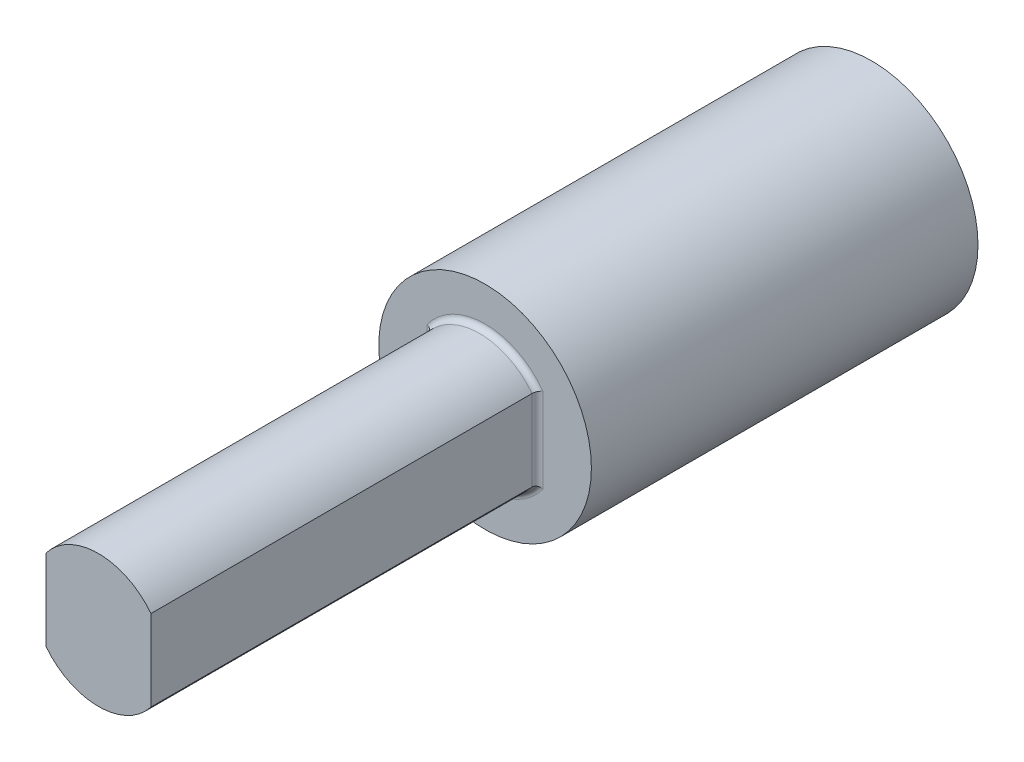
ISO-10303-21;
HEADER;
FILE_DESCRIPTION(('STEP AP214'),'2;1');
FILE_NAME('part.step','',(''),(''),'','','');
FILE_SCHEMA(('AUTOMOTIVE_DESIGN { 1 0 10303 214 1 1 1 1 }'));
ENDSEC;
DATA;
#1=APPLICATION_CONTEXT('core data for automotive mechanical design processes');
#2=APPLICATION_PROTOCOL_DEFINITION('international standard','automotive_design',2000,#1);
#3=PRODUCT_CONTEXT('',#1,'mechanical');
#4=PRODUCT('Part','Part','',(#3));
#5=PRODUCT_RELATED_PRODUCT_CATEGORY('part','',(#4));
#6=PRODUCT_DEFINITION_FORMATION('','',#4);
#7=PRODUCT_DEFINITION_CONTEXT('part definition',#1,'design');
#8=PRODUCT_DEFINITION('design','',#6,#7);
#9=PRODUCT_DEFINITION_SHAPE('','',#8);
#10=(LENGTH_UNIT() NAMED_UNIT(*) SI_UNIT(.MILLI.,.METRE.));
#11=(NAMED_UNIT(*) PLANE_ANGLE_UNIT() SI_UNIT($,.RADIAN.));
#12=(NAMED_UNIT(*) SI_UNIT($,.STERADIAN.) SOLID_ANGLE_UNIT());
#13=UNCERTAINTY_MEASURE_WITH_UNIT(LENGTH_MEASURE(1.E-05),#10,'distance_accuracy_value','');
#14=(GEOMETRIC_REPRESENTATION_CONTEXT(3) GLOBAL_UNCERTAINTY_ASSIGNED_CONTEXT((#13)) GLOBAL_UNIT_ASSIGNED_CONTEXT((#10,
#11,#12)) REPRESENTATION_CONTEXT('',''));
#15=CARTESIAN_POINT('',(0.,0.,0.));
#16=DIRECTION('',(0.,0.,1.));
#17=DIRECTION('',(1.,0.,0.));
#18=AXIS2_PLACEMENT_3D('',#15,#16,#17);
#19=CARTESIAN_POINT('',(0.,0.,-70.));
#20=DIRECTION('',(0.,0.,1.));
#21=DIRECTION('',(1.,0.,0.));
#22=AXIS2_PLACEMENT_3D('',#19,#20,#21);
#23=CYLINDRICAL_SURFACE('',#22,19.25);
#24=CARTESIAN_POINT('',(0.,0.,-70.));
#25=DIRECTION('',(0.,0.,1.));
#26=DIRECTION('',(1.,0.,0.));
#27=AXIS2_PLACEMENT_3D('',#24,#25,#26);
#28=CIRCLE('',#27,19.25);
#29=CARTESIAN_POINT('',(19.25,0.,-70.));
#30=VERTEX_POINT('',#29);
#31=EDGE_CURVE('E137',#30,#30,#28,.T.);
#32=ORIENTED_EDGE('',*,*,#31,.T.);
#33=EDGE_LOOP('',(#32));
#34=FACE_BOUND('',#33,.T.);
#35=CARTESIAN_POINT('',(0.,0.,0.));
#36=DIRECTION('',(0.,0.,1.));
#37=DIRECTION('',(1.,0.,0.));
#38=AXIS2_PLACEMENT_3D('',#35,#36,#37);
#39=CIRCLE('',#38,19.25);
#40=CARTESIAN_POINT('',(19.25,0.,0.));
#41=VERTEX_POINT('',#40);
#42=EDGE_CURVE('E115',#41,#41,#39,.T.);
#43=ORIENTED_EDGE('',*,*,#42,.F.);
#44=EDGE_LOOP('',(#43));
#45=FACE_BOUND('',#44,.T.);
#46=ADVANCED_FACE('F41',(#34,#45),#23,.T.);
#47=CARTESIAN_POINT('',(0.,0.,-70.));
#48=DIRECTION('',(0.,0.,1.));
#49=DIRECTION('',(1.,0.,0.));
#50=AXIS2_PLACEMENT_3D('',#47,#48,#49);
#51=PLANE('',#50);
#52=ORIENTED_EDGE('',*,*,#31,.F.);
#53=EDGE_LOOP('',(#52));
#54=FACE_BOUND('',#53,.T.);
#55=ADVANCED_FACE('F201',(#54),#51,.F.);
#56=CARTESIAN_POINT('',(0.,0.,0.));
#57=DIRECTION('',(0.,0.,1.));
#58=DIRECTION('',(1.,0.,0.));
#59=AXIS2_PLACEMENT_3D('',#56,#57,#58);
#60=PLANE('',#59);
#61=DIRECTION('',(0.,1.,0.));
#62=VECTOR('',#61,1.);
#63=CARTESIAN_POINT('',(10.5,0.,0.));
#64=LINE('',#63,#62);
#65=CARTESIAN_POINT('',(10.5,7.66485485837811,0.));
#66=VERTEX_POINT('',#65);
#67=CARTESIAN_POINT('',(10.5,-7.66485485837811,0.));
#68=VERTEX_POINT('',#67);
#69=EDGE_CURVE('E148',#66,#68,#64,.F.);
#70=ORIENTED_EDGE('',*,*,#69,.T.);
#71=CARTESIAN_POINT('',(0.,0.,0.));
#72=DIRECTION('',(0.,0.,1.));
#73=DIRECTION('',(1.,0.,0.));
#74=AXIS2_PLACEMENT_3D('',#71,#72,#73);
#75=CIRCLE('',#74,13.);
#76=CARTESIAN_POINT('',(-10.5,-7.66485485837811,0.));
#77=VERTEX_POINT('',#76);
#78=EDGE_CURVE('E157',#68,#77,#75,.F.);
#79=ORIENTED_EDGE('',*,*,#78,.T.);
#80=DIRECTION('',(0.,1.,0.));
#81=VECTOR('',#80,1.);
#82=CARTESIAN_POINT('',(-10.5,7.33143914930759,0.));
#83=LINE('',#82,#81);
#84=CARTESIAN_POINT('',(-10.4999999999999,7.66485485837811,0.));
#85=VERTEX_POINT('',#84);
#86=EDGE_CURVE('E154',#77,#85,#83,.T.);
#87=ORIENTED_EDGE('',*,*,#86,.T.);
#88=CARTESIAN_POINT('',(0.,0.,0.));
#89=DIRECTION('',(0.,0.,1.));
#90=DIRECTION('',(1.,0.,0.));
#91=AXIS2_PLACEMENT_3D('',#88,#89,#90);
#92=CIRCLE('',#91,13.);
#93=EDGE_CURVE('E151',#85,#66,#92,.F.);
#94=ORIENTED_EDGE('',*,*,#93,.T.);
#95=EDGE_LOOP('',(#70,#79,#87,#94));
#96=FACE_BOUND('',#95,.T.);
#97=ORIENTED_EDGE('',*,*,#42,.T.);
#98=EDGE_LOOP('',(#97));
#99=FACE_BOUND('',#98,.T.);
#100=ADVANCED_FACE('F206',(#96,#99),#60,.T.);
#101=CARTESIAN_POINT('',(0.,0.,70.));
#102=DIRECTION('',(0.,0.,-1.));
#103=DIRECTION('',(-1.,0.,0.));
#104=AXIS2_PLACEMENT_3D('',#101,#102,#103);
#105=CYLINDRICAL_SURFACE('',#104,12.);
#106=DIRECTION('',(0.,0.,-1.));
#107=VECTOR('',#106,1.);
#108=CARTESIAN_POINT('',(9.5,7.33143914930759,70.));
#109=LINE('',#108,#107);
#110=CARTESIAN_POINT('',(9.5,7.33143914930759,70.));
#111=VERTEX_POINT('',#110);
#112=CARTESIAN_POINT('',(9.5,7.33143914930759,1.));
#113=VERTEX_POINT('',#112);
#114=EDGE_CURVE('E129',#111,#113,#109,.T.);
#115=ORIENTED_EDGE('',*,*,#114,.T.);
#116=CARTESIAN_POINT('',(0.,0.,1.));
#117=DIRECTION('',(0.,0.,1.));
#118=DIRECTION('',(1.,0.,0.));
#119=AXIS2_PLACEMENT_3D('',#116,#117,#118);
#120=CIRCLE('',#119,12.);
#121=CARTESIAN_POINT('',(-9.5,7.33143914930759,1.));
#122=VERTEX_POINT('',#121);
#123=EDGE_CURVE('E56',#113,#122,#120,.T.);
#124=ORIENTED_EDGE('',*,*,#123,.T.);
#125=DIRECTION('',(0.,0.,-1.));
#126=VECTOR('',#125,1.);
#127=CARTESIAN_POINT('',(-9.5,7.33143914930759,70.));
#128=LINE('',#127,#126);
#129=CARTESIAN_POINT('',(-9.5,7.33143914930759,70.));
#130=VERTEX_POINT('',#129);
#131=EDGE_CURVE('E110',#130,#122,#128,.T.);
#132=ORIENTED_EDGE('',*,*,#131,.F.);
#133=CARTESIAN_POINT('',(0.,0.,70.));
#134=DIRECTION('',(0.,0.,1.));
#135=DIRECTION('',(1.,0.,0.));
#136=AXIS2_PLACEMENT_3D('',#133,#134,#135);
#137=CIRCLE('',#136,12.);
#138=EDGE_CURVE('E102',#111,#130,#137,.T.);
#139=ORIENTED_EDGE('',*,*,#138,.F.);
#140=EDGE_LOOP('',(#115,#124,#132,#139));
#141=FACE_BOUND('',#140,.T.);
#142=ADVANCED_FACE('F111',(#141),#105,.T.);
#143=CARTESIAN_POINT('',(-9.5,0.,70.));
#144=DIRECTION('',(-1.,0.,0.));
#145=DIRECTION('',(0.,0.,1.));
#146=AXIS2_PLACEMENT_3D('',#143,#144,#145);
#147=PLANE('',#146);
#148=ORIENTED_EDGE('',*,*,#131,.T.);
#149=DIRECTION('',(0.,1.,0.));
#150=VECTOR('',#149,1.);
#151=CARTESIAN_POINT('',(-9.5,-7.33143914930759,1.));
#152=LINE('',#151,#150);
#153=CARTESIAN_POINT('',(-9.5,-7.33143914930759,1.));
#154=VERTEX_POINT('',#153);
#155=EDGE_CURVE('E161',#122,#154,#152,.F.);
#156=ORIENTED_EDGE('',*,*,#155,.T.);
#157=DIRECTION('',(0.,0.,-1.));
#158=VECTOR('',#157,1.);
#159=CARTESIAN_POINT('',(-9.5,-7.33143914930759,70.));
#160=LINE('',#159,#158);
#161=CARTESIAN_POINT('',(-9.5,-7.33143914930759,70.));
#162=VERTEX_POINT('',#161);
#163=EDGE_CURVE('E116',#162,#154,#160,.T.);
#164=ORIENTED_EDGE('',*,*,#163,.F.);
#165=DIRECTION('',(0.,1.,0.));
#166=VECTOR('',#165,1.);
#167=CARTESIAN_POINT('',(-9.5,0.,70.));
#168=LINE('',#167,#166);
#169=EDGE_CURVE('E105',#162,#130,#168,.T.);
#170=ORIENTED_EDGE('',*,*,#169,.T.);
#171=EDGE_LOOP('',(#148,#156,#164,#170));
#172=FACE_BOUND('',#171,.T.);
#173=ADVANCED_FACE('F118',(#172),#147,.T.);
#174=CARTESIAN_POINT('',(0.,0.,70.));
#175=DIRECTION('',(0.,0.,-1.));
#176=DIRECTION('',(-1.,0.,0.));
#177=AXIS2_PLACEMENT_3D('',#174,#175,#176);
#178=CYLINDRICAL_SURFACE('',#177,12.);
#179=ORIENTED_EDGE('',*,*,#163,.T.);
#180=CARTESIAN_POINT('',(0.,0.,1.));
#181=DIRECTION('',(0.,0.,1.));
#182=DIRECTION('',(1.,0.,0.));
#183=AXIS2_PLACEMENT_3D('',#180,#181,#182);
#184=CIRCLE('',#183,12.);
#185=CARTESIAN_POINT('',(9.5,-7.33143914930759,1.));
#186=VERTEX_POINT('',#185);
#187=EDGE_CURVE('E141',#154,#186,#184,.T.);
#188=ORIENTED_EDGE('',*,*,#187,.T.);
#189=DIRECTION('',(0.,0.,-1.));
#190=VECTOR('',#189,1.);
#191=CARTESIAN_POINT('',(9.5,-7.33143914930759,70.));
#192=LINE('',#191,#190);
#193=CARTESIAN_POINT('',(9.5,-7.33143914930759,70.));
#194=VERTEX_POINT('',#193);
#195=EDGE_CURVE('E132',#194,#186,#192,.T.);
#196=ORIENTED_EDGE('',*,*,#195,.F.);
#197=CARTESIAN_POINT('',(0.,0.,70.));
#198=DIRECTION('',(0.,0.,1.));
#199=DIRECTION('',(1.,0.,0.));
#200=AXIS2_PLACEMENT_3D('',#197,#198,#199);
#201=CIRCLE('',#200,12.);
#202=EDGE_CURVE('E122',#162,#194,#201,.T.);
#203=ORIENTED_EDGE('',*,*,#202,.F.);
#204=EDGE_LOOP('',(#179,#188,#196,#203));
#205=FACE_BOUND('',#204,.T.);
#206=ADVANCED_FACE('F218',(#205),#178,.T.);
#207=CARTESIAN_POINT('',(9.5,0.,70.));
#208=DIRECTION('',(-1.,0.,0.));
#209=DIRECTION('',(0.,-1.,0.));
#210=AXIS2_PLACEMENT_3D('',#207,#208,#209);
#211=PLANE('',#210);
#212=ORIENTED_EDGE('',*,*,#195,.T.);
#213=DIRECTION('',(0.,1.,0.));
#214=VECTOR('',#213,1.);
#215=CARTESIAN_POINT('',(9.5,0.,1.));
#216=LINE('',#215,#214);
#217=EDGE_CURVE('E11',#186,#113,#216,.T.);
#218=ORIENTED_EDGE('',*,*,#217,.T.);
#219=ORIENTED_EDGE('',*,*,#114,.F.);
#220=DIRECTION('',(0.,1.,0.));
#221=VECTOR('',#220,1.);
#222=CARTESIAN_POINT('',(9.5,0.,70.));
#223=LINE('',#222,#221);
#224=EDGE_CURVE('E107',#194,#111,#223,.T.);
#225=ORIENTED_EDGE('',*,*,#224,.F.);
#226=EDGE_LOOP('',(#212,#218,#219,#225));
#227=FACE_BOUND('',#226,.T.);
#228=ADVANCED_FACE('F221',(#227),#211,.F.);
#229=CARTESIAN_POINT('',(0.,0.,70.));
#230=DIRECTION('',(0.,0.,1.));
#231=DIRECTION('',(1.,0.,0.));
#232=AXIS2_PLACEMENT_3D('',#229,#230,#231);
#233=PLANE('',#232);
#234=ORIENTED_EDGE('',*,*,#138,.T.);
#235=ORIENTED_EDGE('',*,*,#169,.F.);
#236=ORIENTED_EDGE('',*,*,#202,.T.);
#237=ORIENTED_EDGE('',*,*,#224,.T.);
#238=EDGE_LOOP('',(#234,#235,#236,#237));
#239=FACE_BOUND('',#238,.T.);
#240=ADVANCED_FACE('F103',(#239),#233,.T.);
#241=CARTESIAN_POINT('',(0.,0.,1.));
#242=DIRECTION('',(0.,0.,1.));
#243=DIRECTION('',(1.,0.,0.));
#244=AXIS2_PLACEMENT_3D('',#241,#242,#243);
#245=TOROIDAL_SURFACE('',#244,13.,1.);
#246=CARTESIAN_POINT('',(9.5,7.33143914930759,1.));
#247=CARTESIAN_POINT('',(9.49999942388547,7.33143885881453,0.972940038365854));
#248=CARTESIAN_POINT('',(9.50109911104481,7.33181395260441,0.945893462720221));
#249=CARTESIAN_POINT('',(9.50548112618962,7.3333080166293,0.892002714732208));
#250=CARTESIAN_POINT('',(9.50876310359682,7.33442686738201,0.865158510579874));
#251=CARTESIAN_POINT('',(9.52182930230833,7.33887974103794,0.785343960199747));
#252=CARTESIAN_POINT('',(9.53483404569742,7.34331018166113,0.732922921046102));
#253=CARTESIAN_POINT('',(9.56895737520105,7.35491808602666,0.631158040179033));
#254=CARTESIAN_POINT('',(9.59007539158393,7.36209535688048,0.581813982676002));
#255=CARTESIAN_POINT('',(9.63969429725521,7.37892553366993,0.48744188202364));
#256=CARTESIAN_POINT('',(9.66819678549049,7.38857897576211,0.44241477651293));
#257=CARTESIAN_POINT('',(9.73240242773029,7.41027206667128,0.35678605119288));
#258=CARTESIAN_POINT('',(9.7682566635561,7.42236167106739,0.316310637989109));
#259=CARTESIAN_POINT('',(9.84564654736767,7.44838249690017,0.241907238312027));
#260=CARTESIAN_POINT('',(9.88718413572958,7.46231434725067,0.207981497567512));
#261=CARTESIAN_POINT('',(9.9769956679938,7.4923437417004,0.145835111245717));
#262=CARTESIAN_POINT('',(10.0255038423541,7.50851511638955,0.117989004922754));
#263=CARTESIAN_POINT('',(10.1261596792915,7.54195448479989,0.0708441834516122));
#264=CARTESIAN_POINT('',(10.178307292704,7.55922246370695,0.0515453528654981));
#265=CARTESIAN_POINT('',(10.2740623960042,7.5908174400502,0.0248579930401668));
#266=CARTESIAN_POINT('',(10.317266359174,7.60503365529372,0.0158507897216857));
#267=CARTESIAN_POINT('',(10.404375638498,7.63361523426678,0.00361472645099552));
#268=CARTESIAN_POINT('',(10.4482794404949,7.6479802572761,0.000374750390053819));
#269=CARTESIAN_POINT('',(10.4947797375985,7.66315205567353,1.01949595025676E-05));
#270=CARTESIAN_POINT('',(10.4973899357124,7.66400355037099,-2.63404867122226E-08));
#271=CARTESIAN_POINT('',(10.5,7.66485485837795,0.));
#272=B_SPLINE_CURVE_WITH_KNOTS('',3,(#246,#247,#248,#249,#250,#251,#252,#253,#254,#255,#256,
#257,#258,#259,#260,#261,#262,#263,#264,#265,#266,#267,#268,#269,#270,#271),.UNSPECIFIED.,.F.,
.F.,(4,2,2,2,2,2,2,2,2,2,2,2,4),(0.,0.0811285880901532,0.162244146267959,0.323975620387288,
0.485695739446198,0.647450904789898,0.812941395386048,0.978488528397443,1.15239421122511,
1.32629754524296,1.46506129709445,1.60355729634404,1.61179398619676),.UNSPECIFIED.);
#273=EDGE_CURVE('E309',#66,#113,#272,.F.);
#274=ORIENTED_EDGE('',*,*,#273,.F.);
#275=ORIENTED_EDGE('',*,*,#93,.F.);
#276=CARTESIAN_POINT('',(-9.5,7.33143914930759,1.));
#277=CARTESIAN_POINT('',(-9.49999942388547,7.33143885881453,0.972940038365853));
#278=CARTESIAN_POINT('',(-9.50109911104481,7.33181395260441,0.94589346272022));
#279=CARTESIAN_POINT('',(-9.50548112618962,7.3333080166293,0.892002714732207));
#280=CARTESIAN_POINT('',(-9.50876310359682,7.33442686738201,0.865158510579873));
#281=CARTESIAN_POINT('',(-9.52182930230833,7.33887974103794,0.785343960199747));
#282=CARTESIAN_POINT('',(-9.53483404569742,7.34331018166113,0.732922921046102));
#283=CARTESIAN_POINT('',(-9.56895737520105,7.35491808602666,0.631158040179033));
#284=CARTESIAN_POINT('',(-9.59007539158393,7.36209535688048,0.581813982676002));
#285=CARTESIAN_POINT('',(-9.63969429725521,7.37892553366993,0.48744188202364));
#286=CARTESIAN_POINT('',(-9.66819678549049,7.38857897576211,0.44241477651293));
#287=CARTESIAN_POINT('',(-9.73240242773029,7.41027206667128,0.35678605119288));
#288=CARTESIAN_POINT('',(-9.7682566635561,7.42236167106739,0.316310637989109));
#289=CARTESIAN_POINT('',(-9.84564654736767,7.44838249690018,0.241907238312027));
#290=CARTESIAN_POINT('',(-9.88718413572958,7.46231434725068,0.207981497567512));
#291=CARTESIAN_POINT('',(-9.9769956679938,7.4923437417004,0.145835111245717));
#292=CARTESIAN_POINT('',(-10.0255038423541,7.50851511638953,0.117989004922754));
#293=CARTESIAN_POINT('',(-10.1261596792915,7.54195448479992,0.0708441834516119));
#294=CARTESIAN_POINT('',(-10.178307292704,7.55922246370706,0.0515453528654977));
#295=CARTESIAN_POINT('',(-10.2740623960042,7.59081744005012,0.0248579930401661));
#296=CARTESIAN_POINT('',(-10.317266359174,7.60503365529344,0.0158507897216848));
#297=CARTESIAN_POINT('',(-10.4043756384979,7.63361523426707,0.00361472645099497));
#298=CARTESIAN_POINT('',(-10.4482794404945,7.64798025727715,0.000374750390053431));
#299=CARTESIAN_POINT('',(-10.4947797375984,7.66315205567366,1.01949595021389E-05));
#300=CARTESIAN_POINT('',(-10.4973899357124,7.66400355037106,-2.63404871437903E-08));
#301=CARTESIAN_POINT('',(-10.5,7.66485485837795,0.));
#302=B_SPLINE_CURVE_WITH_KNOTS('',3,(#276,#277,#278,#279,#280,#281,#282,#283,#284,#285,#286,
#287,#288,#289,#290,#291,#292,#293,#294,#295,#296,#297,#298,#299,#300,#301),.UNSPECIFIED.,.F.,
.F.,(4,2,2,2,2,2,2,2,2,2,2,2,4),(0.,0.0811285880901532,0.162244146267959,0.323975620387287,
0.485695739446198,0.647450904789897,0.812941395386047,0.978488528397443,1.1523942112251,
1.32629754524296,1.46506129709446,1.60355729634404,1.61179398619676),.UNSPECIFIED.);
#303=EDGE_CURVE('E46',#122,#85,#302,.T.);
#304=ORIENTED_EDGE('',*,*,#303,.F.);
#305=ORIENTED_EDGE('',*,*,#123,.F.);
#306=EDGE_LOOP('',(#274,#275,#304,#305));
#307=FACE_BOUND('',#306,.T.);
#308=ADVANCED_FACE('F43',(#307),#245,.F.);
#309=CARTESIAN_POINT('',(-10.5,0.,1.));
#310=DIRECTION('',(0.,-1.,0.));
#311=DIRECTION('',(0.,0.,-1.));
#312=AXIS2_PLACEMENT_3D('',#309,#310,#311);
#313=CYLINDRICAL_SURFACE('',#312,1.);
#314=ORIENTED_EDGE('',*,*,#303,.T.);
#315=ORIENTED_EDGE('',*,*,#86,.F.);
#316=CARTESIAN_POINT('',(-9.5,-7.33143914930759,1.));
#317=CARTESIAN_POINT('',(-9.49999942388547,-7.33143885881453,0.972940038365853));
#318=CARTESIAN_POINT('',(-9.50109911104481,-7.33181395260441,0.94589346272022));
#319=CARTESIAN_POINT('',(-9.50548112618962,-7.3333080166293,0.892002714732207));
#320=CARTESIAN_POINT('',(-9.50876310359682,-7.33442686738201,0.865158510579873));
#321=CARTESIAN_POINT('',(-9.52182930230833,-7.33887974103794,0.785343960199747));
#322=CARTESIAN_POINT('',(-9.53483404569742,-7.34331018166113,0.732922921046102));
#323=CARTESIAN_POINT('',(-9.56895737520105,-7.35491808602666,0.631158040179032));
#324=CARTESIAN_POINT('',(-9.59007539158393,-7.36209535688048,0.581813982676002));
#325=CARTESIAN_POINT('',(-9.63969429725521,-7.37892553366993,0.487441882023639));
#326=CARTESIAN_POINT('',(-9.66819678549049,-7.38857897576211,0.442414776512929));
#327=CARTESIAN_POINT('',(-9.73240242773029,-7.41027206667128,0.356786051192879));
#328=CARTESIAN_POINT('',(-9.7682566635561,-7.42236167106739,0.316310637989108));
#329=CARTESIAN_POINT('',(-9.84564654736767,-7.44838249690018,0.241907238312026));
#330=CARTESIAN_POINT('',(-9.88718413572958,-7.46231434725068,0.207981497567512));
#331=CARTESIAN_POINT('',(-9.9769956679938,-7.4923437417004,0.145835111245717));
#332=CARTESIAN_POINT('',(-10.0255038423541,-7.50851511638953,0.117989004922755));
#333=CARTESIAN_POINT('',(-10.1261596792915,-7.54195448479993,0.0708441834516124));
#334=CARTESIAN_POINT('',(-10.178307292704,-7.55922246370706,0.0515453528654977));
#335=CARTESIAN_POINT('',(-10.2740623960042,-7.59081744005012,0.0248579930401658));
#336=CARTESIAN_POINT('',(-10.3172663591741,-7.60503365529344,0.0158507897216846));
#337=CARTESIAN_POINT('',(-10.4043756384979,-7.63361523426708,0.0036147264509951));
#338=CARTESIAN_POINT('',(-10.4482794404945,-7.64798025727718,0.00037475039005372));
#339=CARTESIAN_POINT('',(-10.4947797375984,-7.66315205567366,1.01949595021719E-05));
#340=CARTESIAN_POINT('',(-10.4973899357124,-7.66400355037106,-2.63404871265817E-08));
#341=CARTESIAN_POINT('',(-10.5,-7.66485485837795,0.));
#342=B_SPLINE_CURVE_WITH_KNOTS('',3,(#316,#317,#318,#319,#320,#321,#322,#323,#324,#325,#326,
#327,#328,#329,#330,#331,#332,#333,#334,#335,#336,#337,#338,#339,#340,#341),.UNSPECIFIED.,.F.,
.F.,(4,2,2,2,2,2,2,2,2,2,2,2,4),(0.,0.0811285880901532,0.162244146267959,0.323975620387288,
0.485695739446199,0.647450904789897,0.812941395386049,0.978488528397443,1.1523942112251,
1.32629754524296,1.46506129709446,1.60355729634404,1.61179398619676),.UNSPECIFIED.);
#343=EDGE_CURVE('E175',#154,#77,#342,.T.);
#344=ORIENTED_EDGE('',*,*,#343,.F.);
#345=ORIENTED_EDGE('',*,*,#155,.F.);
#346=EDGE_LOOP('',(#314,#315,#344,#345));
#347=FACE_BOUND('',#346,.T.);
#348=ADVANCED_FACE('F187',(#347),#313,.F.);
#349=CARTESIAN_POINT('',(10.5,0.,1.));
#350=DIRECTION('',(0.,1.,0.));
#351=DIRECTION('',(-1.,0.,0.));
#352=AXIS2_PLACEMENT_3D('',#349,#350,#351);
#353=CYLINDRICAL_SURFACE('',#352,1.);
#354=ORIENTED_EDGE('',*,*,#273,.T.);
#355=ORIENTED_EDGE('',*,*,#217,.F.);
#356=CARTESIAN_POINT('',(9.5,-7.33143914930759,1.));
#357=CARTESIAN_POINT('',(9.49999942388547,-7.33143885881453,0.972940038365854));
#358=CARTESIAN_POINT('',(9.50109911104481,-7.33181395260441,0.945893462720221));
#359=CARTESIAN_POINT('',(9.50548112618962,-7.3333080166293,0.892002714732208));
#360=CARTESIAN_POINT('',(9.50876310359682,-7.33442686738201,0.865158510579874));
#361=CARTESIAN_POINT('',(9.52182930230832,-7.33887974103794,0.785343960199747));
#362=CARTESIAN_POINT('',(9.53483404569742,-7.34331018166113,0.732922921046102));
#363=CARTESIAN_POINT('',(9.56895737520105,-7.35491808602666,0.631158040179033));
#364=CARTESIAN_POINT('',(9.59007539158393,-7.36209535688048,0.581813982676002));
#365=CARTESIAN_POINT('',(9.63969429725521,-7.37892553366993,0.48744188202364));
#366=CARTESIAN_POINT('',(9.66819678549049,-7.38857897576211,0.44241477651293));
#367=CARTESIAN_POINT('',(9.73240242773029,-7.41027206667128,0.35678605119288));
#368=CARTESIAN_POINT('',(9.7682566635561,-7.42236167106739,0.31631063798911));
#369=CARTESIAN_POINT('',(9.84564654736767,-7.44838249690017,0.241907238312028));
#370=CARTESIAN_POINT('',(9.88718413572958,-7.46231434725067,0.207981497567513));
#371=CARTESIAN_POINT('',(9.9769956679938,-7.4923437417004,0.145835111245717));
#372=CARTESIAN_POINT('',(10.0255038423541,-7.50851511638955,0.117989004922754));
#373=CARTESIAN_POINT('',(10.1261596792915,-7.54195448479989,0.0708441834516118));
#374=CARTESIAN_POINT('',(10.178307292704,-7.55922246370694,0.0515453528654974));
#375=CARTESIAN_POINT('',(10.2740623960042,-7.59081744005021,0.0248579930401661));
#376=CARTESIAN_POINT('',(10.317266359174,-7.60503365529373,0.0158507897216852));
#377=CARTESIAN_POINT('',(10.404375638498,-7.63361523426677,0.00361472645099561));
#378=CARTESIAN_POINT('',(10.4482794404949,-7.64798025727605,0.000374750390054228));
#379=CARTESIAN_POINT('',(10.4947797375985,-7.66315205567353,1.01949595026125E-05));
#380=CARTESIAN_POINT('',(10.4973899357124,-7.66400355037099,-2.63404866899159E-08));
#381=CARTESIAN_POINT('',(10.5,-7.66485485837795,0.));
#382=B_SPLINE_CURVE_WITH_KNOTS('',3,(#356,#357,#358,#359,#360,#361,#362,#363,#364,#365,#366,
#367,#368,#369,#370,#371,#372,#373,#374,#375,#376,#377,#378,#379,#380,#381),.UNSPECIFIED.,.F.,
.F.,(4,2,2,2,2,2,2,2,2,2,2,2,4),(0.,0.0811285880901531,0.162244146267959,0.323975620387287,
0.485695739446199,0.647450904789898,0.812941395386046,0.978488528397444,1.15239421122511,
1.32629754524296,1.46506129709445,1.60355729634404,1.61179398619676),.UNSPECIFIED.);
#383=EDGE_CURVE('E166',#68,#186,#382,.F.);
#384=ORIENTED_EDGE('',*,*,#383,.F.);
#385=ORIENTED_EDGE('',*,*,#69,.F.);
#386=EDGE_LOOP('',(#354,#355,#384,#385));
#387=FACE_BOUND('',#386,.T.);
#388=ADVANCED_FACE('F180',(#387),#353,.F.);
#389=CARTESIAN_POINT('',(0.,0.,1.));
#390=DIRECTION('',(0.,0.,1.));
#391=DIRECTION('',(1.,0.,0.));
#392=AXIS2_PLACEMENT_3D('',#389,#390,#391);
#393=TOROIDAL_SURFACE('',#392,13.,1.);
#394=ORIENTED_EDGE('',*,*,#343,.T.);
#395=ORIENTED_EDGE('',*,*,#78,.F.);
#396=ORIENTED_EDGE('',*,*,#383,.T.);
#397=ORIENTED_EDGE('',*,*,#187,.F.);
#398=EDGE_LOOP('',(#394,#395,#396,#397));
#399=FACE_BOUND('',#398,.T.);
#400=ADVANCED_FACE('F183',(#399),#393,.F.);
#401=CLOSED_SHELL('',(#46,#55,#100,#142,#173,#206,#228,#240,#308,#348,#388,#400));
#402=MANIFOLD_SOLID_BREP('B2',#401);
#403=ADVANCED_BREP_SHAPE_REPRESENTATION('',(#18,#402),#14);
#404=SHAPE_DEFINITION_REPRESENTATION(#9,#403);
ENDSEC;
END-ISO-10303-21;
